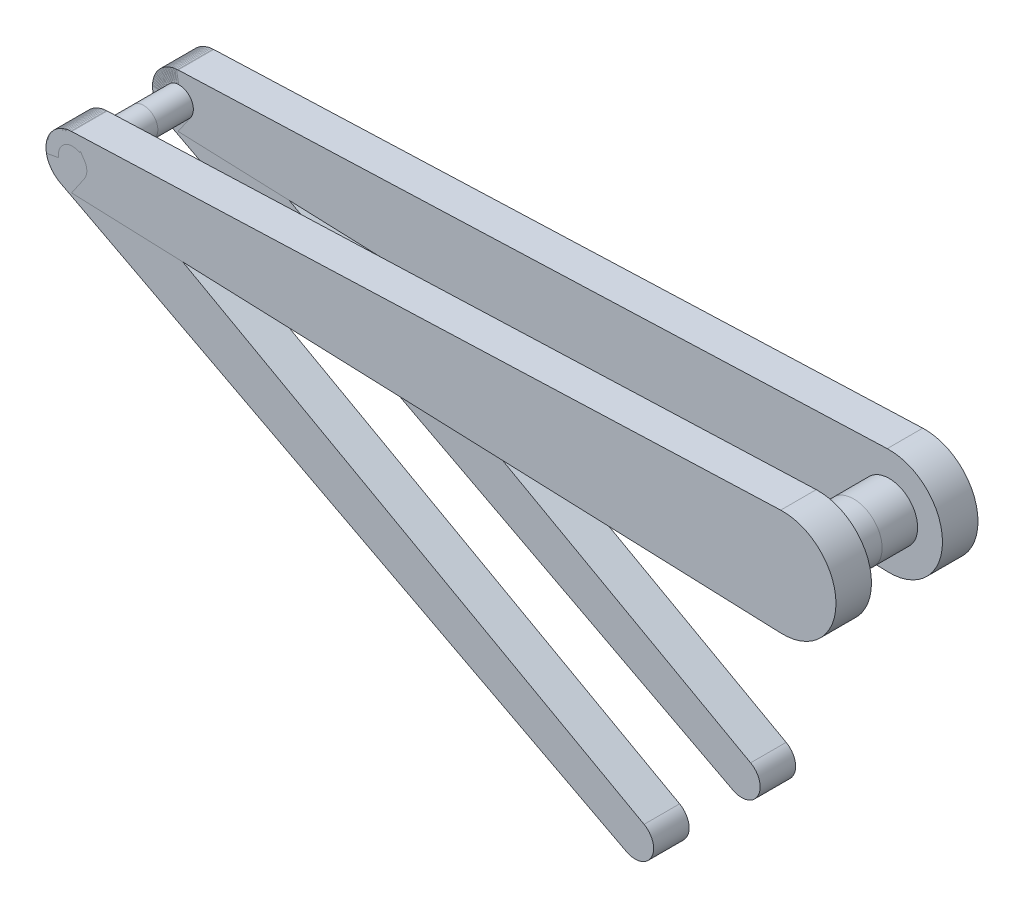
ISO-10303-21;
HEADER;
FILE_DESCRIPTION(('STEP AP214'),'2;1');
FILE_NAME('part.step','',(''),(''),'','','');
FILE_SCHEMA(('AUTOMOTIVE_DESIGN { 1 0 10303 214 1 1 1 1 }'));
ENDSEC;
DATA;
#1=APPLICATION_CONTEXT('core data for automotive mechanical design processes');
#2=APPLICATION_PROTOCOL_DEFINITION('international standard','automotive_design',2000,#1);
#3=PRODUCT_CONTEXT('',#1,'mechanical');
#4=PRODUCT('Part','Part','',(#3));
#5=PRODUCT_RELATED_PRODUCT_CATEGORY('part','',(#4));
#6=PRODUCT_DEFINITION_FORMATION('','',#4);
#7=PRODUCT_DEFINITION_CONTEXT('part definition',#1,'design');
#8=PRODUCT_DEFINITION('design','',#6,#7);
#9=PRODUCT_DEFINITION_SHAPE('','',#8);
#10=(LENGTH_UNIT() NAMED_UNIT(*) SI_UNIT(.MILLI.,.METRE.));
#11=(NAMED_UNIT(*) PLANE_ANGLE_UNIT() SI_UNIT($,.RADIAN.));
#12=(NAMED_UNIT(*) SI_UNIT($,.STERADIAN.) SOLID_ANGLE_UNIT());
#13=UNCERTAINTY_MEASURE_WITH_UNIT(LENGTH_MEASURE(1.E-05),#10,'distance_accuracy_value','');
#14=(GEOMETRIC_REPRESENTATION_CONTEXT(3) GLOBAL_UNCERTAINTY_ASSIGNED_CONTEXT((#13)) GLOBAL_UNIT_ASSIGNED_CONTEXT((#10,
#11,#12)) REPRESENTATION_CONTEXT('',''));
#15=CARTESIAN_POINT('',(0.,0.,0.));
#16=DIRECTION('',(0.,0.,1.));
#17=DIRECTION('',(1.,0.,0.));
#18=AXIS2_PLACEMENT_3D('',#15,#16,#17);
#19=CARTESIAN_POINT('',(0.,0.,0.));
#20=DIRECTION('',(0.,0.,1.));
#21=DIRECTION('',(1.,0.,0.));
#22=AXIS2_PLACEMENT_3D('',#19,#20,#21);
#23=PLANE('',#22);
#24=CARTESIAN_POINT('',(-200.,0.,0.));
#25=DIRECTION('',(0.,0.,1.));
#26=DIRECTION('',(1.,0.,0.));
#27=AXIS2_PLACEMENT_3D('',#24,#25,#26);
#28=CIRCLE('',#27,3.99999999999999);
#29=CARTESIAN_POINT('',(-196.,0.,0.));
#30=VERTEX_POINT('',#29);
#31=EDGE_CURVE('E229',#30,#30,#28,.T.);
#32=ORIENTED_EDGE('',*,*,#31,.T.);
#33=EDGE_LOOP('',(#32));
#34=FACE_BOUND('',#33,.T.);
#35=DIRECTION('',(0.999296627633657,0.0375000000000001,0.));
#36=VECTOR('',#35,1.);
#37=CARTESIAN_POINT('',(-0.562500000000002,14.9894494145049,0.));
#38=LINE('',#37,#36);
#39=CARTESIAN_POINT('',(-200.28125,7.49472470725241,0.));
#40=VERTEX_POINT('',#39);
#41=CARTESIAN_POINT('',(-0.562500000000002,14.9894494145049,0.));
#42=VERTEX_POINT('',#41);
#43=EDGE_CURVE('E113',#40,#42,#38,.T.);
#44=ORIENTED_EDGE('',*,*,#43,.T.);
#45=CARTESIAN_POINT('',(0.,0.,0.));
#46=DIRECTION('',(0.,0.,1.));
#47=DIRECTION('',(1.,0.,0.));
#48=AXIS2_PLACEMENT_3D('',#45,#46,#47);
#49=CIRCLE('',#48,15.);
#50=CARTESIAN_POINT('',(-0.562499999999998,-14.9894494145049,0.));
#51=VERTEX_POINT('',#50);
#52=EDGE_CURVE('E119',#51,#42,#49,.T.);
#53=ORIENTED_EDGE('',*,*,#52,.F.);
#54=DIRECTION('',(0.999296627633657,-0.0374999999999999,0.));
#55=VECTOR('',#54,1.);
#56=CARTESIAN_POINT('',(-0.562499999999998,-14.9894494145049,0.));
#57=LINE('',#56,#55);
#58=CARTESIAN_POINT('',(-200.28125,-7.49472470725246,0.));
#59=VERTEX_POINT('',#58);
#60=EDGE_CURVE('E81',#59,#51,#57,.T.);
#61=ORIENTED_EDGE('',*,*,#60,.F.);
#62=CARTESIAN_POINT('',(-200.,0.,0.));
#63=DIRECTION('',(0.,0.,1.));
#64=DIRECTION('',(1.,0.,0.));
#65=AXIS2_PLACEMENT_3D('',#62,#63,#64);
#66=CIRCLE('',#65,7.50000000000001);
#67=EDGE_CURVE('E105',#40,#59,#66,.T.);
#68=ORIENTED_EDGE('',*,*,#67,.F.);
#69=EDGE_LOOP('',(#44,#53,#61,#68));
#70=FACE_BOUND('',#69,.T.);
#71=CARTESIAN_POINT('',(0.,0.,0.));
#72=DIRECTION('',(0.,0.,1.));
#73=DIRECTION('',(1.,0.,0.));
#74=AXIS2_PLACEMENT_3D('',#71,#72,#73);
#75=CIRCLE('',#74,8.);
#76=CARTESIAN_POINT('',(8.,0.,0.));
#77=VERTEX_POINT('',#76);
#78=EDGE_CURVE('E12',#77,#77,#75,.F.);
#79=ORIENTED_EDGE('',*,*,#78,.F.);
#80=EDGE_LOOP('',(#79));
#81=FACE_BOUND('',#80,.T.);
#82=ADVANCED_FACE('F46',(#34,#70,#81),#23,.F.);
#83=CARTESIAN_POINT('',(-0.562500000000002,14.9894494145049,10.));
#84=DIRECTION('',(-0.0375000000000001,0.999296627633657,0.));
#85=DIRECTION('',(-0.999296627633657,-0.0375000000000001,0.));
#86=AXIS2_PLACEMENT_3D('',#83,#84,#85);
#87=PLANE('',#86);
#88=ORIENTED_EDGE('',*,*,#43,.F.);
#89=DIRECTION('',(0.,0.,-1.));
#90=VECTOR('',#89,1.);
#91=CARTESIAN_POINT('',(-200.28125,7.49472470725241,10.));
#92=LINE('',#91,#90);
#93=CARTESIAN_POINT('',(-200.28125,7.49472470725241,10.));
#94=VERTEX_POINT('',#93);
#95=EDGE_CURVE('E56',#94,#40,#92,.T.);
#96=ORIENTED_EDGE('',*,*,#95,.F.);
#97=DIRECTION('',(0.999296627633657,0.0375000000000001,0.));
#98=VECTOR('',#97,1.);
#99=CARTESIAN_POINT('',(-0.562500000000002,14.9894494145049,10.));
#100=LINE('',#99,#98);
#101=CARTESIAN_POINT('',(-0.562500000000002,14.9894494145049,10.));
#102=VERTEX_POINT('',#101);
#103=EDGE_CURVE('E99',#94,#102,#100,.T.);
#104=ORIENTED_EDGE('',*,*,#103,.T.);
#105=DIRECTION('',(0.,0.,-1.));
#106=VECTOR('',#105,1.);
#107=CARTESIAN_POINT('',(-0.562500000000002,14.9894494145049,10.));
#108=LINE('',#107,#106);
#109=EDGE_CURVE('E88',#102,#42,#108,.T.);
#110=ORIENTED_EDGE('',*,*,#109,.T.);
#111=EDGE_LOOP('',(#88,#96,#104,#110));
#112=FACE_BOUND('',#111,.T.);
#113=ADVANCED_FACE('F48',(#112),#87,.T.);
#114=CARTESIAN_POINT('',(-200.,0.,10.));
#115=DIRECTION('',(0.,0.,-1.));
#116=DIRECTION('',(-1.,0.,0.));
#117=AXIS2_PLACEMENT_3D('',#114,#115,#116);
#118=CYLINDRICAL_SURFACE('',#117,7.50000000000001);
#119=ORIENTED_EDGE('',*,*,#67,.T.);
#120=DIRECTION('',(0.,0.,-1.));
#121=VECTOR('',#120,1.);
#122=CARTESIAN_POINT('',(-200.28125,-7.49472470725246,10.));
#123=LINE('',#122,#121);
#124=CARTESIAN_POINT('',(-200.28125,-7.49472470725246,10.));
#125=VERTEX_POINT('',#124);
#126=EDGE_CURVE('E102',#125,#59,#123,.T.);
#127=ORIENTED_EDGE('',*,*,#126,.F.);
#128=CARTESIAN_POINT('',(-200.,0.,10.));
#129=DIRECTION('',(0.,0.,1.));
#130=DIRECTION('',(1.,0.,0.));
#131=AXIS2_PLACEMENT_3D('',#128,#129,#130);
#132=CIRCLE('',#131,7.50000000000001);
#133=EDGE_CURVE('E94',#94,#125,#132,.T.);
#134=ORIENTED_EDGE('',*,*,#133,.F.);
#135=ORIENTED_EDGE('',*,*,#95,.T.);
#136=EDGE_LOOP('',(#119,#127,#134,#135));
#137=FACE_BOUND('',#136,.T.);
#138=ADVANCED_FACE('F103',(#137),#118,.T.);
#139=CARTESIAN_POINT('',(-0.562499999999998,-14.9894494145049,10.));
#140=DIRECTION('',(0.0374999999999998,0.999296627633657,0.));
#141=DIRECTION('',(-0.999296627633657,0.0374999999999999,0.));
#142=AXIS2_PLACEMENT_3D('',#139,#140,#141);
#143=PLANE('',#142);
#144=ORIENTED_EDGE('',*,*,#60,.T.);
#145=DIRECTION('',(0.,0.,-1.));
#146=VECTOR('',#145,1.);
#147=CARTESIAN_POINT('',(-0.562499999999998,-14.9894494145049,10.));
#148=LINE('',#147,#146);
#149=CARTESIAN_POINT('',(-0.562499999999998,-14.9894494145049,10.));
#150=VERTEX_POINT('',#149);
#151=EDGE_CURVE('E106',#150,#51,#148,.T.);
#152=ORIENTED_EDGE('',*,*,#151,.F.);
#153=DIRECTION('',(0.999296627633657,-0.0374999999999999,0.));
#154=VECTOR('',#153,1.);
#155=CARTESIAN_POINT('',(-0.562499999999998,-14.9894494145049,10.));
#156=LINE('',#155,#154);
#157=EDGE_CURVE('E98',#125,#150,#156,.T.);
#158=ORIENTED_EDGE('',*,*,#157,.F.);
#159=ORIENTED_EDGE('',*,*,#126,.T.);
#160=EDGE_LOOP('',(#144,#152,#158,#159));
#161=FACE_BOUND('',#160,.T.);
#162=ADVANCED_FACE('F108',(#161),#143,.F.);
#163=CARTESIAN_POINT('',(0.,0.,10.));
#164=DIRECTION('',(0.,0.,-1.));
#165=DIRECTION('',(-1.,0.,0.));
#166=AXIS2_PLACEMENT_3D('',#163,#164,#165);
#167=CYLINDRICAL_SURFACE('',#166,15.);
#168=ORIENTED_EDGE('',*,*,#52,.T.);
#169=ORIENTED_EDGE('',*,*,#109,.F.);
#170=CARTESIAN_POINT('',(0.,0.,10.));
#171=DIRECTION('',(0.,0.,1.));
#172=DIRECTION('',(1.,0.,0.));
#173=AXIS2_PLACEMENT_3D('',#170,#171,#172);
#174=CIRCLE('',#173,15.);
#175=EDGE_CURVE('E64',#150,#102,#174,.T.);
#176=ORIENTED_EDGE('',*,*,#175,.F.);
#177=ORIENTED_EDGE('',*,*,#151,.T.);
#178=EDGE_LOOP('',(#168,#169,#176,#177));
#179=FACE_BOUND('',#178,.T.);
#180=ADVANCED_FACE('F139',(#179),#167,.T.);
#181=CARTESIAN_POINT('',(0.,0.,10.));
#182=DIRECTION('',(0.,0.,1.));
#183=DIRECTION('',(1.,0.,0.));
#184=AXIS2_PLACEMENT_3D('',#181,#182,#183);
#185=PLANE('',#184);
#186=CARTESIAN_POINT('',(-200.,0.,10.));
#187=DIRECTION('',(0.,0.,1.));
#188=DIRECTION('',(1.,0.,0.));
#189=AXIS2_PLACEMENT_3D('',#186,#187,#188);
#190=CIRCLE('',#189,3.99999999999999);
#191=CARTESIAN_POINT('',(-196.,0.,10.));
#192=VERTEX_POINT('',#191);
#193=EDGE_CURVE('E50',#192,#192,#190,.T.);
#194=ORIENTED_EDGE('',*,*,#193,.F.);
#195=EDGE_LOOP('',(#194));
#196=FACE_BOUND('',#195,.T.);
#197=ORIENTED_EDGE('',*,*,#103,.F.);
#198=ORIENTED_EDGE('',*,*,#133,.T.);
#199=ORIENTED_EDGE('',*,*,#157,.T.);
#200=ORIENTED_EDGE('',*,*,#175,.T.);
#201=EDGE_LOOP('',(#197,#198,#199,#200));
#202=FACE_BOUND('',#201,.T.);
#203=ADVANCED_FACE('F96',(#196,#202),#185,.T.);
#204=CARTESIAN_POINT('',(0.,0.,-10.));
#205=DIRECTION('',(0.,0.,1.));
#206=DIRECTION('',(1.,0.,0.));
#207=AXIS2_PLACEMENT_3D('',#204,#205,#206);
#208=CYLINDRICAL_SURFACE('',#207,8.);
#209=CARTESIAN_POINT('',(0.,0.,-10.));
#210=DIRECTION('',(0.,0.,-1.));
#211=DIRECTION('',(-1.,0.,0.));
#212=AXIS2_PLACEMENT_3D('',#209,#210,#211);
#213=CIRCLE('',#212,8.);
#214=CARTESIAN_POINT('',(-8.,0.,-10.));
#215=VERTEX_POINT('',#214);
#216=EDGE_CURVE('E116',#215,#215,#213,.T.);
#217=ORIENTED_EDGE('',*,*,#216,.F.);
#218=EDGE_LOOP('',(#217));
#219=FACE_BOUND('',#218,.T.);
#220=ORIENTED_EDGE('',*,*,#78,.T.);
#221=EDGE_LOOP('',(#220));
#222=FACE_BOUND('',#221,.T.);
#223=ADVANCED_FACE('F161',(#219,#222),#208,.T.);
#224=CARTESIAN_POINT('',(0.,0.,-10.));
#225=DIRECTION('',(0.,0.,-1.));
#226=DIRECTION('',(-1.,0.,0.));
#227=AXIS2_PLACEMENT_3D('',#224,#225,#226);
#228=PLANE('',#227);
#229=ORIENTED_EDGE('',*,*,#216,.T.);
#230=EDGE_LOOP('',(#229));
#231=FACE_BOUND('',#230,.T.);
#232=ADVANCED_FACE('F169',(#231),#228,.T.);
#233=CARTESIAN_POINT('',(-200.,0.,60.));
#234=DIRECTION('',(0.,0.,-1.));
#235=DIRECTION('',(-1.,0.,0.));
#236=AXIS2_PLACEMENT_3D('',#233,#234,#235);
#237=CYLINDRICAL_SURFACE('',#236,3.99999999999999);
#238=ORIENTED_EDGE('',*,*,#193,.T.);
#239=EDGE_LOOP('',(#238));
#240=FACE_BOUND('',#239,.T.);
#241=ORIENTED_EDGE('',*,*,#31,.F.);
#242=EDGE_LOOP('',(#241));
#243=FACE_BOUND('',#242,.T.);
#244=ADVANCED_FACE('F177',(#240,#243),#237,.F.);
#245=CLOSED_SHELL('',(#82,#113,#138,#162,#180,#203,#223,#232,#244));
#246=MANIFOLD_SOLID_BREP('B2',#245);
#247=CARTESIAN_POINT('',(0.,0.,-20.));
#248=DIRECTION('',(0.,0.,-1.));
#249=DIRECTION('',(1.,0.,0.));
#250=AXIS2_PLACEMENT_3D('',#247,#248,#249);
#251=PLANE('',#250);
#252=CARTESIAN_POINT('',(-200.,0.,-20.));
#253=DIRECTION('',(0.,0.,1.));
#254=DIRECTION('',(1.,0.,0.));
#255=AXIS2_PLACEMENT_3D('',#252,#253,#254);
#256=CIRCLE('',#255,3.99999999999999);
#257=CARTESIAN_POINT('',(-196.,0.,-20.));
#258=VERTEX_POINT('',#257);
#259=EDGE_CURVE('E366',#258,#258,#256,.T.);
#260=ORIENTED_EDGE('',*,*,#259,.F.);
#261=EDGE_LOOP('',(#260));
#262=FACE_BOUND('',#261,.T.);
#263=DIRECTION('',(0.999296627633657,0.0375000000000001,0.));
#264=VECTOR('',#263,1.);
#265=CARTESIAN_POINT('',(-0.562500000000002,14.9894494145049,-20.));
#266=LINE('',#265,#264);
#267=CARTESIAN_POINT('',(-200.28125,7.49472470725241,-20.));
#268=VERTEX_POINT('',#267);
#269=CARTESIAN_POINT('',(-0.562500000000002,14.9894494145049,-20.));
#270=VERTEX_POINT('',#269);
#271=EDGE_CURVE('E317',#268,#270,#266,.T.);
#272=ORIENTED_EDGE('',*,*,#271,.F.);
#273=CARTESIAN_POINT('',(-200.,0.,-20.));
#274=DIRECTION('',(0.,0.,1.));
#275=DIRECTION('',(1.,0.,0.));
#276=AXIS2_PLACEMENT_3D('',#273,#274,#275);
#277=CIRCLE('',#276,7.50000000000001);
#278=CARTESIAN_POINT('',(-200.28125,-7.49472470725246,-20.));
#279=VERTEX_POINT('',#278);
#280=EDGE_CURVE('E320',#268,#279,#277,.T.);
#281=ORIENTED_EDGE('',*,*,#280,.T.);
#282=DIRECTION('',(0.999296627633657,-0.0374999999999999,0.));
#283=VECTOR('',#282,1.);
#284=CARTESIAN_POINT('',(-0.562499999999998,-14.9894494145049,-20.));
#285=LINE('',#284,#283);
#286=CARTESIAN_POINT('',(-0.562499999999998,-14.9894494145049,-20.));
#287=VERTEX_POINT('',#286);
#288=EDGE_CURVE('E303',#279,#287,#285,.T.);
#289=ORIENTED_EDGE('',*,*,#288,.T.);
#290=CARTESIAN_POINT('',(0.,0.,-20.));
#291=DIRECTION('',(0.,0.,1.));
#292=DIRECTION('',(1.,0.,0.));
#293=AXIS2_PLACEMENT_3D('',#290,#291,#292);
#294=CIRCLE('',#293,15.);
#295=EDGE_CURVE('E312',#287,#270,#294,.T.);
#296=ORIENTED_EDGE('',*,*,#295,.T.);
#297=EDGE_LOOP('',(#272,#281,#289,#296));
#298=FACE_BOUND('',#297,.T.);
#299=CARTESIAN_POINT('',(0.,0.,-20.));
#300=DIRECTION('',(0.,0.,1.));
#301=DIRECTION('',(1.,0.,0.));
#302=AXIS2_PLACEMENT_3D('',#299,#300,#301);
#303=CIRCLE('',#302,8.);
#304=CARTESIAN_POINT('',(8.,0.,-20.));
#305=VERTEX_POINT('',#304);
#306=EDGE_CURVE('E44',#305,#305,#303,.F.);
#307=ORIENTED_EDGE('',*,*,#306,.T.);
#308=EDGE_LOOP('',(#307));
#309=FACE_BOUND('',#308,.T.);
#310=ADVANCED_FACE('F249',(#262,#298,#309),#251,.F.);
#311=CARTESIAN_POINT('',(-0.562500000000002,14.9894494145049,-30.));
#312=DIRECTION('',(-0.0375000000000001,0.999296627633657,0.));
#313=DIRECTION('',(-0.999296627633657,-0.0375000000000001,0.));
#314=AXIS2_PLACEMENT_3D('',#311,#312,#313);
#315=PLANE('',#314);
#316=ORIENTED_EDGE('',*,*,#271,.T.);
#317=DIRECTION('',(0.,0.,1.));
#318=VECTOR('',#317,1.);
#319=CARTESIAN_POINT('',(-0.562500000000002,14.9894494145049,-30.));
#320=LINE('',#319,#318);
#321=CARTESIAN_POINT('',(-0.562500000000002,14.9894494145049,-30.));
#322=VERTEX_POINT('',#321);
#323=EDGE_CURVE('E287',#322,#270,#320,.T.);
#324=ORIENTED_EDGE('',*,*,#323,.F.);
#325=DIRECTION('',(0.999296627633657,0.0375000000000001,0.));
#326=VECTOR('',#325,1.);
#327=CARTESIAN_POINT('',(-0.562500000000002,14.9894494145049,-30.));
#328=LINE('',#327,#326);
#329=CARTESIAN_POINT('',(-200.28125,7.49472470725241,-30.));
#330=VERTEX_POINT('',#329);
#331=EDGE_CURVE('E310',#330,#322,#328,.T.);
#332=ORIENTED_EDGE('',*,*,#331,.F.);
#333=DIRECTION('',(0.,0.,1.));
#334=VECTOR('',#333,1.);
#335=CARTESIAN_POINT('',(-200.28125,7.49472470725241,-30.));
#336=LINE('',#335,#334);
#337=EDGE_CURVE('E259',#330,#268,#336,.T.);
#338=ORIENTED_EDGE('',*,*,#337,.T.);
#339=EDGE_LOOP('',(#316,#324,#332,#338));
#340=FACE_BOUND('',#339,.T.);
#341=ADVANCED_FACE('F251',(#340),#315,.T.);
#342=CARTESIAN_POINT('',(-200.,0.,-30.));
#343=DIRECTION('',(0.,0.,1.));
#344=DIRECTION('',(-1.,0.,0.));
#345=AXIS2_PLACEMENT_3D('',#342,#343,#344);
#346=CYLINDRICAL_SURFACE('',#345,7.50000000000001);
#347=ORIENTED_EDGE('',*,*,#280,.F.);
#348=ORIENTED_EDGE('',*,*,#337,.F.);
#349=CARTESIAN_POINT('',(-200.,0.,-30.));
#350=DIRECTION('',(0.,0.,1.));
#351=DIRECTION('',(1.,0.,0.));
#352=AXIS2_PLACEMENT_3D('',#349,#350,#351);
#353=CIRCLE('',#352,7.50000000000001);
#354=CARTESIAN_POINT('',(-200.28125,-7.49472470725246,-30.));
#355=VERTEX_POINT('',#354);
#356=EDGE_CURVE('E294',#330,#355,#353,.T.);
#357=ORIENTED_EDGE('',*,*,#356,.T.);
#358=DIRECTION('',(0.,0.,1.));
#359=VECTOR('',#358,1.);
#360=CARTESIAN_POINT('',(-200.28125,-7.49472470725246,-30.));
#361=LINE('',#360,#359);
#362=EDGE_CURVE('E300',#355,#279,#361,.T.);
#363=ORIENTED_EDGE('',*,*,#362,.T.);
#364=EDGE_LOOP('',(#347,#348,#357,#363));
#365=FACE_BOUND('',#364,.T.);
#366=ADVANCED_FACE('F308',(#365),#346,.T.);
#367=CARTESIAN_POINT('',(-0.562499999999998,-14.9894494145049,-30.));
#368=DIRECTION('',(0.0374999999999998,0.999296627633657,0.));
#369=DIRECTION('',(-0.999296627633657,0.0374999999999999,0.));
#370=AXIS2_PLACEMENT_3D('',#367,#368,#369);
#371=PLANE('',#370);
#372=ORIENTED_EDGE('',*,*,#288,.F.);
#373=ORIENTED_EDGE('',*,*,#362,.F.);
#374=DIRECTION('',(0.999296627633657,-0.0374999999999999,0.));
#375=VECTOR('',#374,1.);
#376=CARTESIAN_POINT('',(-0.562499999999998,-14.9894494145049,-30.));
#377=LINE('',#376,#375);
#378=CARTESIAN_POINT('',(-0.562499999999998,-14.9894494145049,-30.));
#379=VERTEX_POINT('',#378);
#380=EDGE_CURVE('E296',#355,#379,#377,.T.);
#381=ORIENTED_EDGE('',*,*,#380,.T.);
#382=DIRECTION('',(0.,0.,1.));
#383=VECTOR('',#382,1.);
#384=CARTESIAN_POINT('',(-0.562499999999998,-14.9894494145049,-30.));
#385=LINE('',#384,#383);
#386=EDGE_CURVE('E283',#379,#287,#385,.T.);
#387=ORIENTED_EDGE('',*,*,#386,.T.);
#388=EDGE_LOOP('',(#372,#373,#381,#387));
#389=FACE_BOUND('',#388,.T.);
#390=ADVANCED_FACE('F301',(#389),#371,.F.);
#391=CARTESIAN_POINT('',(0.,0.,-30.));
#392=DIRECTION('',(0.,0.,1.));
#393=DIRECTION('',(-1.,0.,0.));
#394=AXIS2_PLACEMENT_3D('',#391,#392,#393);
#395=CYLINDRICAL_SURFACE('',#394,15.);
#396=ORIENTED_EDGE('',*,*,#295,.F.);
#397=ORIENTED_EDGE('',*,*,#386,.F.);
#398=CARTESIAN_POINT('',(0.,0.,-30.));
#399=DIRECTION('',(0.,0.,1.));
#400=DIRECTION('',(1.,0.,0.));
#401=AXIS2_PLACEMENT_3D('',#398,#399,#400);
#402=CIRCLE('',#401,15.);
#403=EDGE_CURVE('E267',#379,#322,#402,.T.);
#404=ORIENTED_EDGE('',*,*,#403,.T.);
#405=ORIENTED_EDGE('',*,*,#323,.T.);
#406=EDGE_LOOP('',(#396,#397,#404,#405));
#407=FACE_BOUND('',#406,.T.);
#408=ADVANCED_FACE('F331',(#407),#395,.T.);
#409=CARTESIAN_POINT('',(0.,0.,-30.));
#410=DIRECTION('',(0.,0.,-1.));
#411=DIRECTION('',(1.,0.,0.));
#412=AXIS2_PLACEMENT_3D('',#409,#410,#411);
#413=PLANE('',#412);
#414=CARTESIAN_POINT('',(-200.,0.,-30.));
#415=DIRECTION('',(0.,0.,1.));
#416=DIRECTION('',(1.,0.,0.));
#417=AXIS2_PLACEMENT_3D('',#414,#415,#416);
#418=CIRCLE('',#417,3.99999999999999);
#419=CARTESIAN_POINT('',(-196.,0.,-30.));
#420=VERTEX_POINT('',#419);
#421=EDGE_CURVE('E253',#420,#420,#418,.T.);
#422=ORIENTED_EDGE('',*,*,#421,.T.);
#423=EDGE_LOOP('',(#422));
#424=FACE_BOUND('',#423,.T.);
#425=ORIENTED_EDGE('',*,*,#331,.T.);
#426=ORIENTED_EDGE('',*,*,#403,.F.);
#427=ORIENTED_EDGE('',*,*,#380,.F.);
#428=ORIENTED_EDGE('',*,*,#356,.F.);
#429=EDGE_LOOP('',(#425,#426,#427,#428));
#430=FACE_BOUND('',#429,.T.);
#431=ADVANCED_FACE('F298',(#424,#430),#413,.T.);
#432=CARTESIAN_POINT('',(0.,0.,-10.));
#433=DIRECTION('',(0.,0.,-1.));
#434=DIRECTION('',(1.,0.,0.));
#435=AXIS2_PLACEMENT_3D('',#432,#433,#434);
#436=CYLINDRICAL_SURFACE('',#435,8.);
#437=CARTESIAN_POINT('',(0.,0.,-10.));
#438=DIRECTION('',(0.,0.,-1.));
#439=DIRECTION('',(-1.,0.,0.));
#440=AXIS2_PLACEMENT_3D('',#437,#438,#439);
#441=CIRCLE('',#440,8.);
#442=CARTESIAN_POINT('',(-8.,0.,-10.));
#443=VERTEX_POINT('',#442);
#444=EDGE_CURVE('E321',#443,#443,#441,.T.);
#445=ORIENTED_EDGE('',*,*,#444,.T.);
#446=EDGE_LOOP('',(#445));
#447=FACE_BOUND('',#446,.T.);
#448=ORIENTED_EDGE('',*,*,#306,.F.);
#449=EDGE_LOOP('',(#448));
#450=FACE_BOUND('',#449,.T.);
#451=ADVANCED_FACE('F338',(#447,#450),#436,.T.);
#452=CARTESIAN_POINT('',(0.,0.,-10.));
#453=DIRECTION('',(0.,0.,1.));
#454=DIRECTION('',(-1.,0.,0.));
#455=AXIS2_PLACEMENT_3D('',#452,#453,#454);
#456=PLANE('',#455);
#457=ORIENTED_EDGE('',*,*,#444,.F.);
#458=EDGE_LOOP('',(#457));
#459=FACE_BOUND('',#458,.T.);
#460=ADVANCED_FACE('F352',(#459),#456,.T.);
#461=CARTESIAN_POINT('',(-200.,0.,-80.));
#462=DIRECTION('',(0.,0.,1.));
#463=DIRECTION('',(-1.,0.,0.));
#464=AXIS2_PLACEMENT_3D('',#461,#462,#463);
#465=CYLINDRICAL_SURFACE('',#464,3.99999999999999);
#466=ORIENTED_EDGE('',*,*,#421,.F.);
#467=EDGE_LOOP('',(#466));
#468=FACE_BOUND('',#467,.T.);
#469=ORIENTED_EDGE('',*,*,#259,.T.);
#470=EDGE_LOOP('',(#469));
#471=FACE_BOUND('',#470,.T.);
#472=ADVANCED_FACE('F356',(#468,#471),#465,.F.);
#473=CLOSED_SHELL('',(#310,#341,#366,#390,#408,#431,#451,#460,#472));
#474=MANIFOLD_SOLID_BREP('B6',#473);
#475=CARTESIAN_POINT('',(0.,0.,0.));
#476=DIRECTION('',(0.,0.,1.));
#477=DIRECTION('',(1.,0.,0.));
#478=AXIS2_PLACEMENT_3D('',#475,#476,#477);
#479=PLANE('',#478);
#480=DIRECTION('',(0.874031845170728,-0.485868638242327,0.));
#481=VECTOR('',#480,1.);
#482=CARTESIAN_POINT('',(-43.5696519386731,-78.3776936399255,0.));
#483=LINE('',#482,#481);
#484=CARTESIAN_POINT('',(-196.355985213183,6.55523883878045,0.));
#485=VERTEX_POINT('',#484);
#486=CARTESIAN_POINT('',(-39.0430632462077,-80.8939949578273,0.));
#487=VERTEX_POINT('',#486);
#488=EDGE_CURVE('E517',#485,#487,#483,.T.);
#489=ORIENTED_EDGE('',*,*,#488,.T.);
#490=CARTESIAN_POINT('',(-41.5710502933571,-85.441605174821,0.));
#491=DIRECTION('',(0.,0.,1.));
#492=DIRECTION('',(1.,0.,0.));
#493=AXIS2_PLACEMENT_3D('',#490,#491,#492);
#494=CIRCLE('',#493,5.20302577316901);
#495=CARTESIAN_POINT('',(-43.9821596482325,-90.0522481749993,0.));
#496=VERTEX_POINT('',#495);
#497=EDGE_CURVE('E523',#496,#487,#494,.T.);
#498=ORIENTED_EDGE('',*,*,#497,.F.);
#499=DIRECTION('',(0.886146484984656,-0.463405229954668,0.));
#500=VECTOR('',#499,1.);
#501=CARTESIAN_POINT('',(-46.4244206545278,-88.775081766952,0.));
#502=LINE('',#501,#500);
#503=CARTESIAN_POINT('',(-203.47553922466,-6.64609863738495,0.));
#504=VERTEX_POINT('',#503);
#505=EDGE_CURVE('E485',#504,#496,#502,.T.);
#506=ORIENTED_EDGE('',*,*,#505,.F.);
#507=CARTESIAN_POINT('',(-200.,0.,0.));
#508=DIRECTION('',(0.,0.,1.));
#509=DIRECTION('',(1.,0.,0.));
#510=AXIS2_PLACEMENT_3D('',#507,#508,#509);
#511=CIRCLE('',#510,7.50000000000001);
#512=EDGE_CURVE('E509',#485,#504,#511,.T.);
#513=ORIENTED_EDGE('',*,*,#512,.F.);
#514=EDGE_LOOP('',(#489,#498,#506,#513));
#515=FACE_BOUND('',#514,.T.);
#516=CARTESIAN_POINT('',(-200.,0.,0.));
#517=DIRECTION('',(0.,0.,1.));
#518=DIRECTION('',(1.,0.,0.));
#519=AXIS2_PLACEMENT_3D('',#516,#517,#518);
#520=CIRCLE('',#519,3.99999999999999);
#521=CARTESIAN_POINT('',(-196.,0.,0.));
#522=VERTEX_POINT('',#521);
#523=EDGE_CURVE('E247',#522,#522,#520,.F.);
#524=ORIENTED_EDGE('',*,*,#523,.F.);
#525=EDGE_LOOP('',(#524));
#526=FACE_BOUND('',#525,.T.);
#527=ADVANCED_FACE('F451',(#515,#526),#479,.F.);
#528=CARTESIAN_POINT('',(-43.5696519386731,-78.3776936399255,10.));
#529=DIRECTION('',(0.485868638242327,0.874031845170728,0.));
#530=DIRECTION('',(-0.874031845170728,0.485868638242327,0.));
#531=AXIS2_PLACEMENT_3D('',#528,#529,#530);
#532=PLANE('',#531);
#533=ORIENTED_EDGE('',*,*,#488,.F.);
#534=DIRECTION('',(0.,0.,-1.));
#535=VECTOR('',#534,1.);
#536=CARTESIAN_POINT('',(-196.355985213183,6.55523883878045,10.));
#537=LINE('',#536,#535);
#538=CARTESIAN_POINT('',(-196.355985213183,6.55523883878045,10.));
#539=VERTEX_POINT('',#538);
#540=EDGE_CURVE('E460',#539,#485,#537,.T.);
#541=ORIENTED_EDGE('',*,*,#540,.F.);
#542=DIRECTION('',(0.874031845170728,-0.485868638242327,0.));
#543=VECTOR('',#542,1.);
#544=CARTESIAN_POINT('',(-43.5696519386731,-78.3776936399255,10.));
#545=LINE('',#544,#543);
#546=CARTESIAN_POINT('',(-39.0430632462077,-80.8939949578273,10.));
#547=VERTEX_POINT('',#546);
#548=EDGE_CURVE('E503',#539,#547,#545,.T.);
#549=ORIENTED_EDGE('',*,*,#548,.T.);
#550=DIRECTION('',(0.,0.,-1.));
#551=VECTOR('',#550,1.);
#552=CARTESIAN_POINT('',(-39.0430632462077,-80.8939949578273,10.));
#553=LINE('',#552,#551);
#554=EDGE_CURVE('E492',#547,#487,#553,.T.);
#555=ORIENTED_EDGE('',*,*,#554,.T.);
#556=EDGE_LOOP('',(#533,#541,#549,#555));
#557=FACE_BOUND('',#556,.T.);
#558=ADVANCED_FACE('F453',(#557),#532,.T.);
#559=CARTESIAN_POINT('',(-200.,0.,10.));
#560=DIRECTION('',(0.,0.,-1.));
#561=DIRECTION('',(-1.,0.,0.));
#562=AXIS2_PLACEMENT_3D('',#559,#560,#561);
#563=CYLINDRICAL_SURFACE('',#562,7.50000000000001);
#564=ORIENTED_EDGE('',*,*,#512,.T.);
#565=DIRECTION('',(0.,0.,-1.));
#566=VECTOR('',#565,1.);
#567=CARTESIAN_POINT('',(-203.47553922466,-6.64609863738495,10.));
#568=LINE('',#567,#566);
#569=CARTESIAN_POINT('',(-203.47553922466,-6.64609863738495,10.));
#570=VERTEX_POINT('',#569);
#571=EDGE_CURVE('E506',#570,#504,#568,.T.);
#572=ORIENTED_EDGE('',*,*,#571,.F.);
#573=CARTESIAN_POINT('',(-200.,0.,10.));
#574=DIRECTION('',(0.,0.,1.));
#575=DIRECTION('',(1.,0.,0.));
#576=AXIS2_PLACEMENT_3D('',#573,#574,#575);
#577=CIRCLE('',#576,7.50000000000001);
#578=EDGE_CURVE('E498',#539,#570,#577,.T.);
#579=ORIENTED_EDGE('',*,*,#578,.F.);
#580=ORIENTED_EDGE('',*,*,#540,.T.);
#581=EDGE_LOOP('',(#564,#572,#579,#580));
#582=FACE_BOUND('',#581,.T.);
#583=ADVANCED_FACE('F507',(#582),#563,.T.);
#584=CARTESIAN_POINT('',(-46.4244206545278,-88.775081766952,10.));
#585=DIRECTION('',(0.463405229954668,0.886146484984656,0.));
#586=DIRECTION('',(-0.886146484984656,0.463405229954668,0.));
#587=AXIS2_PLACEMENT_3D('',#584,#585,#586);
#588=PLANE('',#587);
#589=ORIENTED_EDGE('',*,*,#505,.T.);
#590=DIRECTION('',(0.,0.,-1.));
#591=VECTOR('',#590,1.);
#592=CARTESIAN_POINT('',(-43.9821596482325,-90.0522481749993,10.));
#593=LINE('',#592,#591);
#594=CARTESIAN_POINT('',(-43.9821596482325,-90.0522481749993,10.));
#595=VERTEX_POINT('',#594);
#596=EDGE_CURVE('E510',#595,#496,#593,.T.);
#597=ORIENTED_EDGE('',*,*,#596,.F.);
#598=DIRECTION('',(0.886146484984656,-0.463405229954668,0.));
#599=VECTOR('',#598,1.);
#600=CARTESIAN_POINT('',(-46.4244206545278,-88.775081766952,10.));
#601=LINE('',#600,#599);
#602=EDGE_CURVE('E502',#570,#595,#601,.T.);
#603=ORIENTED_EDGE('',*,*,#602,.F.);
#604=ORIENTED_EDGE('',*,*,#571,.T.);
#605=EDGE_LOOP('',(#589,#597,#603,#604));
#606=FACE_BOUND('',#605,.T.);
#607=ADVANCED_FACE('F512',(#606),#588,.F.);
#608=CARTESIAN_POINT('',(-41.5710502933571,-85.441605174821,10.));
#609=DIRECTION('',(0.,0.,-1.));
#610=DIRECTION('',(-1.,0.,0.));
#611=AXIS2_PLACEMENT_3D('',#608,#609,#610);
#612=CYLINDRICAL_SURFACE('',#611,5.20302577316901);
#613=ORIENTED_EDGE('',*,*,#497,.T.);
#614=ORIENTED_EDGE('',*,*,#554,.F.);
#615=CARTESIAN_POINT('',(-41.5710502933571,-85.441605174821,10.));
#616=DIRECTION('',(0.,0.,1.));
#617=DIRECTION('',(1.,0.,0.));
#618=AXIS2_PLACEMENT_3D('',#615,#616,#617);
#619=CIRCLE('',#618,5.20302577316901);
#620=EDGE_CURVE('E468',#595,#547,#619,.T.);
#621=ORIENTED_EDGE('',*,*,#620,.F.);
#622=ORIENTED_EDGE('',*,*,#596,.T.);
#623=EDGE_LOOP('',(#613,#614,#621,#622));
#624=FACE_BOUND('',#623,.T.);
#625=ADVANCED_FACE('F540',(#624),#612,.T.);
#626=CARTESIAN_POINT('',(0.,0.,10.));
#627=DIRECTION('',(0.,0.,1.));
#628=DIRECTION('',(1.,0.,0.));
#629=AXIS2_PLACEMENT_3D('',#626,#627,#628);
#630=PLANE('',#629);
#631=ORIENTED_EDGE('',*,*,#548,.F.);
#632=ORIENTED_EDGE('',*,*,#578,.T.);
#633=ORIENTED_EDGE('',*,*,#602,.T.);
#634=ORIENTED_EDGE('',*,*,#620,.T.);
#635=EDGE_LOOP('',(#631,#632,#633,#634));
#636=FACE_BOUND('',#635,.T.);
#637=ADVANCED_FACE('F500',(#636),#630,.T.);
#638=CARTESIAN_POINT('',(-200.,0.,-10.));
#639=DIRECTION('',(0.,0.,1.));
#640=DIRECTION('',(1.,0.,0.));
#641=AXIS2_PLACEMENT_3D('',#638,#639,#640);
#642=CYLINDRICAL_SURFACE('',#641,3.99999999999999);
#643=CARTESIAN_POINT('',(-200.,0.,-10.));
#644=DIRECTION('',(0.,0.,-1.));
#645=DIRECTION('',(-1.,0.,0.));
#646=AXIS2_PLACEMENT_3D('',#643,#644,#645);
#647=CIRCLE('',#646,3.99999999999999);
#648=CARTESIAN_POINT('',(-204.,0.,-10.));
#649=VERTEX_POINT('',#648);
#650=EDGE_CURVE('E520',#649,#649,#647,.T.);
#651=ORIENTED_EDGE('',*,*,#650,.F.);
#652=EDGE_LOOP('',(#651));
#653=FACE_BOUND('',#652,.T.);
#654=ORIENTED_EDGE('',*,*,#523,.T.);
#655=EDGE_LOOP('',(#654));
#656=FACE_BOUND('',#655,.T.);
#657=ADVANCED_FACE('F562',(#653,#656),#642,.T.);
#658=CARTESIAN_POINT('',(-200.,0.,-10.));
#659=DIRECTION('',(0.,0.,-1.));
#660=DIRECTION('',(-1.,0.,0.));
#661=AXIS2_PLACEMENT_3D('',#658,#659,#660);
#662=PLANE('',#661);
#663=ORIENTED_EDGE('',*,*,#650,.T.);
#664=EDGE_LOOP('',(#663));
#665=FACE_BOUND('',#664,.T.);
#666=ADVANCED_FACE('F569',(#665),#662,.T.);
#667=CLOSED_SHELL('',(#527,#558,#583,#607,#625,#637,#657,#666));
#668=MANIFOLD_SOLID_BREP('B38',#667);
#669=CARTESIAN_POINT('',(0.,0.,-20.));
#670=DIRECTION('',(0.,0.,-1.));
#671=DIRECTION('',(1.,0.,0.));
#672=AXIS2_PLACEMENT_3D('',#669,#670,#671);
#673=PLANE('',#672);
#674=DIRECTION('',(0.874031845170728,-0.485868638242327,0.));
#675=VECTOR('',#674,1.);
#676=CARTESIAN_POINT('',(-43.5696519386731,-78.3776936399255,-20.));
#677=LINE('',#676,#675);
#678=CARTESIAN_POINT('',(-196.355985213183,6.55523883878045,-20.));
#679=VERTEX_POINT('',#678);
#680=CARTESIAN_POINT('',(-39.0430632462077,-80.8939949578273,-20.));
#681=VERTEX_POINT('',#680);
#682=EDGE_CURVE('E690',#679,#681,#677,.T.);
#683=ORIENTED_EDGE('',*,*,#682,.F.);
#684=CARTESIAN_POINT('',(-200.,0.,-20.));
#685=DIRECTION('',(0.,0.,1.));
#686=DIRECTION('',(1.,0.,0.));
#687=AXIS2_PLACEMENT_3D('',#684,#685,#686);
#688=CIRCLE('',#687,7.50000000000001);
#689=CARTESIAN_POINT('',(-203.47553922466,-6.64609863738495,-20.));
#690=VERTEX_POINT('',#689);
#691=EDGE_CURVE('E693',#679,#690,#688,.T.);
#692=ORIENTED_EDGE('',*,*,#691,.T.);
#693=DIRECTION('',(0.886146484984656,-0.463405229954668,0.));
#694=VECTOR('',#693,1.);
#695=CARTESIAN_POINT('',(-46.4244206545278,-88.775081766952,-20.));
#696=LINE('',#695,#694);
#697=CARTESIAN_POINT('',(-43.9821596482325,-90.0522481749993,-20.));
#698=VERTEX_POINT('',#697);
#699=EDGE_CURVE('E676',#690,#698,#696,.T.);
#700=ORIENTED_EDGE('',*,*,#699,.T.);
#701=CARTESIAN_POINT('',(-41.5710502933571,-85.441605174821,-20.));
#702=DIRECTION('',(0.,0.,1.));
#703=DIRECTION('',(1.,0.,0.));
#704=AXIS2_PLACEMENT_3D('',#701,#702,#703);
#705=CIRCLE('',#704,5.20302577316901);
#706=EDGE_CURVE('E685',#698,#681,#705,.T.);
#707=ORIENTED_EDGE('',*,*,#706,.T.);
#708=EDGE_LOOP('',(#683,#692,#700,#707));
#709=FACE_BOUND('',#708,.T.);
#710=CARTESIAN_POINT('',(-200.,0.,-20.));
#711=DIRECTION('',(0.,0.,1.));
#712=DIRECTION('',(1.,0.,0.));
#713=AXIS2_PLACEMENT_3D('',#710,#711,#712);
#714=CIRCLE('',#713,3.99999999999999);
#715=CARTESIAN_POINT('',(-196.,0.,-20.));
#716=VERTEX_POINT('',#715);
#717=EDGE_CURVE('E449',#716,#716,#714,.F.);
#718=ORIENTED_EDGE('',*,*,#717,.T.);
#719=EDGE_LOOP('',(#718));
#720=FACE_BOUND('',#719,.T.);
#721=ADVANCED_FACE('F623',(#709,#720),#673,.F.);
#722=CARTESIAN_POINT('',(-43.5696519386731,-78.3776936399255,-30.));
#723=DIRECTION('',(0.485868638242327,0.874031845170728,0.));
#724=DIRECTION('',(-0.874031845170728,0.485868638242327,0.));
#725=AXIS2_PLACEMENT_3D('',#722,#723,#724);
#726=PLANE('',#725);
#727=ORIENTED_EDGE('',*,*,#682,.T.);
#728=DIRECTION('',(0.,0.,1.));
#729=VECTOR('',#728,1.);
#730=CARTESIAN_POINT('',(-39.0430632462077,-80.8939949578273,-30.));
#731=LINE('',#730,#729);
#732=CARTESIAN_POINT('',(-39.0430632462077,-80.8939949578273,-30.));
#733=VERTEX_POINT('',#732);
#734=EDGE_CURVE('E660',#733,#681,#731,.T.);
#735=ORIENTED_EDGE('',*,*,#734,.F.);
#736=DIRECTION('',(0.874031845170728,-0.485868638242327,0.));
#737=VECTOR('',#736,1.);
#738=CARTESIAN_POINT('',(-43.5696519386731,-78.3776936399255,-30.));
#739=LINE('',#738,#737);
#740=CARTESIAN_POINT('',(-196.355985213183,6.55523883878045,-30.));
#741=VERTEX_POINT('',#740);
#742=EDGE_CURVE('E683',#741,#733,#739,.T.);
#743=ORIENTED_EDGE('',*,*,#742,.F.);
#744=DIRECTION('',(0.,0.,1.));
#745=VECTOR('',#744,1.);
#746=CARTESIAN_POINT('',(-196.355985213183,6.55523883878045,-30.));
#747=LINE('',#746,#745);
#748=EDGE_CURVE('E632',#741,#679,#747,.T.);
#749=ORIENTED_EDGE('',*,*,#748,.T.);
#750=EDGE_LOOP('',(#727,#735,#743,#749));
#751=FACE_BOUND('',#750,.T.);
#752=ADVANCED_FACE('F625',(#751),#726,.T.);
#753=CARTESIAN_POINT('',(-200.,0.,-30.));
#754=DIRECTION('',(0.,0.,1.));
#755=DIRECTION('',(-1.,0.,0.));
#756=AXIS2_PLACEMENT_3D('',#753,#754,#755);
#757=CYLINDRICAL_SURFACE('',#756,7.50000000000001);
#758=ORIENTED_EDGE('',*,*,#691,.F.);
#759=ORIENTED_EDGE('',*,*,#748,.F.);
#760=CARTESIAN_POINT('',(-200.,0.,-30.));
#761=DIRECTION('',(0.,0.,1.));
#762=DIRECTION('',(1.,0.,0.));
#763=AXIS2_PLACEMENT_3D('',#760,#761,#762);
#764=CIRCLE('',#763,7.50000000000001);
#765=CARTESIAN_POINT('',(-203.47553922466,-6.64609863738495,-30.));
#766=VERTEX_POINT('',#765);
#767=EDGE_CURVE('E667',#741,#766,#764,.T.);
#768=ORIENTED_EDGE('',*,*,#767,.T.);
#769=DIRECTION('',(0.,0.,1.));
#770=VECTOR('',#769,1.);
#771=CARTESIAN_POINT('',(-203.47553922466,-6.64609863738495,-30.));
#772=LINE('',#771,#770);
#773=EDGE_CURVE('E673',#766,#690,#772,.T.);
#774=ORIENTED_EDGE('',*,*,#773,.T.);
#775=EDGE_LOOP('',(#758,#759,#768,#774));
#776=FACE_BOUND('',#775,.T.);
#777=ADVANCED_FACE('F681',(#776),#757,.T.);
#778=CARTESIAN_POINT('',(-46.4244206545278,-88.775081766952,-30.));
#779=DIRECTION('',(0.463405229954668,0.886146484984656,0.));
#780=DIRECTION('',(-0.886146484984656,0.463405229954668,0.));
#781=AXIS2_PLACEMENT_3D('',#778,#779,#780);
#782=PLANE('',#781);
#783=ORIENTED_EDGE('',*,*,#699,.F.);
#784=ORIENTED_EDGE('',*,*,#773,.F.);
#785=DIRECTION('',(0.886146484984656,-0.463405229954668,0.));
#786=VECTOR('',#785,1.);
#787=CARTESIAN_POINT('',(-46.4244206545278,-88.775081766952,-30.));
#788=LINE('',#787,#786);
#789=CARTESIAN_POINT('',(-43.9821596482325,-90.0522481749993,-30.));
#790=VERTEX_POINT('',#789);
#791=EDGE_CURVE('E669',#766,#790,#788,.T.);
#792=ORIENTED_EDGE('',*,*,#791,.T.);
#793=DIRECTION('',(0.,0.,1.));
#794=VECTOR('',#793,1.);
#795=CARTESIAN_POINT('',(-43.9821596482325,-90.0522481749993,-30.));
#796=LINE('',#795,#794);
#797=EDGE_CURVE('E656',#790,#698,#796,.T.);
#798=ORIENTED_EDGE('',*,*,#797,.T.);
#799=EDGE_LOOP('',(#783,#784,#792,#798));
#800=FACE_BOUND('',#799,.T.);
#801=ADVANCED_FACE('F674',(#800),#782,.F.);
#802=CARTESIAN_POINT('',(-41.5710502933571,-85.441605174821,-30.));
#803=DIRECTION('',(0.,0.,1.));
#804=DIRECTION('',(-1.,0.,0.));
#805=AXIS2_PLACEMENT_3D('',#802,#803,#804);
#806=CYLINDRICAL_SURFACE('',#805,5.20302577316901);
#807=ORIENTED_EDGE('',*,*,#706,.F.);
#808=ORIENTED_EDGE('',*,*,#797,.F.);
#809=CARTESIAN_POINT('',(-41.5710502933571,-85.441605174821,-30.));
#810=DIRECTION('',(0.,0.,1.));
#811=DIRECTION('',(1.,0.,0.));
#812=AXIS2_PLACEMENT_3D('',#809,#810,#811);
#813=CIRCLE('',#812,5.20302577316901);
#814=EDGE_CURVE('E640',#790,#733,#813,.T.);
#815=ORIENTED_EDGE('',*,*,#814,.T.);
#816=ORIENTED_EDGE('',*,*,#734,.T.);
#817=EDGE_LOOP('',(#807,#808,#815,#816));
#818=FACE_BOUND('',#817,.T.);
#819=ADVANCED_FACE('F703',(#818),#806,.T.);
#820=CARTESIAN_POINT('',(0.,0.,-30.));
#821=DIRECTION('',(0.,0.,-1.));
#822=DIRECTION('',(1.,0.,0.));
#823=AXIS2_PLACEMENT_3D('',#820,#821,#822);
#824=PLANE('',#823);
#825=ORIENTED_EDGE('',*,*,#742,.T.);
#826=ORIENTED_EDGE('',*,*,#814,.F.);
#827=ORIENTED_EDGE('',*,*,#791,.F.);
#828=ORIENTED_EDGE('',*,*,#767,.F.);
#829=EDGE_LOOP('',(#825,#826,#827,#828));
#830=FACE_BOUND('',#829,.T.);
#831=ADVANCED_FACE('F671',(#830),#824,.T.);
#832=CARTESIAN_POINT('',(-200.,0.,-10.));
#833=DIRECTION('',(0.,0.,-1.));
#834=DIRECTION('',(1.,0.,0.));
#835=AXIS2_PLACEMENT_3D('',#832,#833,#834);
#836=CYLINDRICAL_SURFACE('',#835,3.99999999999999);
#837=CARTESIAN_POINT('',(-200.,0.,-10.));
#838=DIRECTION('',(0.,0.,-1.));
#839=DIRECTION('',(-1.,0.,0.));
#840=AXIS2_PLACEMENT_3D('',#837,#838,#839);
#841=CIRCLE('',#840,3.99999999999999);
#842=CARTESIAN_POINT('',(-204.,0.,-10.));
#843=VERTEX_POINT('',#842);
#844=EDGE_CURVE('E694',#843,#843,#841,.T.);
#845=ORIENTED_EDGE('',*,*,#844,.T.);
#846=EDGE_LOOP('',(#845));
#847=FACE_BOUND('',#846,.T.);
#848=ORIENTED_EDGE('',*,*,#717,.F.);
#849=EDGE_LOOP('',(#848));
#850=FACE_BOUND('',#849,.T.);
#851=ADVANCED_FACE('F710',(#847,#850),#836,.T.);
#852=CARTESIAN_POINT('',(-200.,0.,-10.));
#853=DIRECTION('',(0.,0.,1.));
#854=DIRECTION('',(-1.,0.,0.));
#855=AXIS2_PLACEMENT_3D('',#852,#853,#854);
#856=PLANE('',#855);
#857=ORIENTED_EDGE('',*,*,#844,.F.);
#858=EDGE_LOOP('',(#857));
#859=FACE_BOUND('',#858,.T.);
#860=ADVANCED_FACE('F721',(#859),#856,.T.);
#861=CLOSED_SHELL('',(#721,#752,#777,#801,#819,#831,#851,#860));
#862=MANIFOLD_SOLID_BREP('B241',#861);
#863=ADVANCED_BREP_SHAPE_REPRESENTATION('',(#18,#246,#474,#668,#862),#14);
#864=SHAPE_DEFINITION_REPRESENTATION(#9,#863);
ENDSEC;
END-ISO-10303-21;
